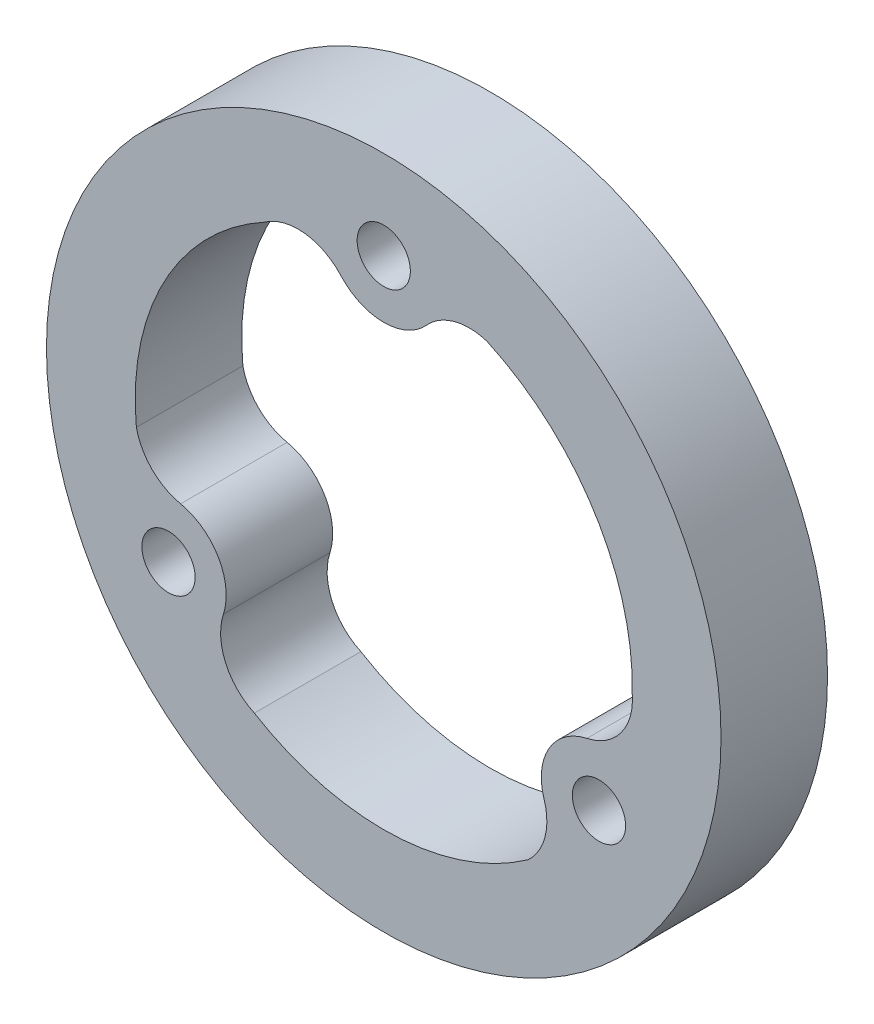
ISO-10303-21;
HEADER;
FILE_DESCRIPTION(('STEP AP214'),'2;1');
FILE_NAME('part.step','',(''),(''),'','','');
FILE_SCHEMA(('AUTOMOTIVE_DESIGN { 1 0 10303 214 1 1 1 1 }'));
ENDSEC;
DATA;
#1=APPLICATION_CONTEXT('core data for automotive mechanical design processes');
#2=APPLICATION_PROTOCOL_DEFINITION('international standard','automotive_design',2000,#1);
#3=PRODUCT_CONTEXT('',#1,'mechanical');
#4=PRODUCT('Part','Part','',(#3));
#5=PRODUCT_RELATED_PRODUCT_CATEGORY('part','',(#4));
#6=PRODUCT_DEFINITION_FORMATION('','',#4);
#7=PRODUCT_DEFINITION_CONTEXT('part definition',#1,'design');
#8=PRODUCT_DEFINITION('design','',#6,#7);
#9=PRODUCT_DEFINITION_SHAPE('','',#8);
#10=(LENGTH_UNIT() NAMED_UNIT(*) SI_UNIT(.MILLI.,.METRE.));
#11=(NAMED_UNIT(*) PLANE_ANGLE_UNIT() SI_UNIT($,.RADIAN.));
#12=(NAMED_UNIT(*) SI_UNIT($,.STERADIAN.) SOLID_ANGLE_UNIT());
#13=UNCERTAINTY_MEASURE_WITH_UNIT(LENGTH_MEASURE(1.E-05),#10,'distance_accuracy_value','');
#14=(GEOMETRIC_REPRESENTATION_CONTEXT(3) GLOBAL_UNCERTAINTY_ASSIGNED_CONTEXT((#13)) GLOBAL_UNIT_ASSIGNED_CONTEXT((#10,
#11,#12)) REPRESENTATION_CONTEXT('',''));
#15=CARTESIAN_POINT('',(0.,0.,0.));
#16=DIRECTION('',(0.,0.,1.));
#17=DIRECTION('',(1.,0.,0.));
#18=AXIS2_PLACEMENT_3D('',#15,#16,#17);
#19=CARTESIAN_POINT('',(0.,0.,6.));
#20=DIRECTION('',(0.,0.,1.));
#21=DIRECTION('',(1.,0.,0.));
#22=AXIS2_PLACEMENT_3D('',#19,#20,#21);
#23=PLANE('',#22);
#24=CARTESIAN_POINT('',(0.,0.,6.));
#25=DIRECTION('',(0.,0.,1.));
#26=DIRECTION('',(1.,0.,0.));
#27=AXIS2_PLACEMENT_3D('',#24,#25,#26);
#28=CIRCLE('',#27,14.);
#29=CARTESIAN_POINT('',(13.9959775932849,-0.335575935174573,6.));
#30=VERTEX_POINT('',#29);
#31=CARTESIAN_POINT('',(5.80943087987062,12.7377593340432,6.));
#32=VERTEX_POINT('',#31);
#33=EDGE_CURVE('E130',#30,#32,#28,.T.);
#34=ORIENTED_EDGE('',*,*,#33,.F.);
#35=CARTESIAN_POINT('',(10.7607074751454,-0.644650784804921,6.));
#36=DIRECTION('',(0.,0.,1.));
#37=DIRECTION('',(1.,0.,0.));
#38=AXIS2_PLACEMENT_3D('',#35,#36,#37);
#39=CIRCLE('',#38,3.25);
#40=CARTESIAN_POINT('',(11.4425315640637,-3.82232539240255,6.));
#41=VERTEX_POINT('',#40);
#42=EDGE_CURVE('E122',#41,#30,#39,.T.);
#43=ORIENTED_EDGE('',*,*,#42,.F.);
#44=CARTESIAN_POINT('',(12.124355652982,-7.00000000000017,6.));
#45=DIRECTION('',(0.,0.,-1.));
#46=DIRECTION('',(1.,0.,0.));
#47=AXIS2_PLACEMENT_3D('',#44,#45,#46);
#48=CIRCLE('',#47,3.25);
#49=CARTESIAN_POINT('',(9.03149667338257,-7.99836032188346,6.));
#50=VERTEX_POINT('',#49);
#51=EDGE_CURVE('E165',#50,#41,#48,.T.);
#52=ORIENTED_EDGE('',*,*,#51,.F.);
#53=CARTESIAN_POINT('',(5.93863769378309,-8.99672064376674,6.));
#54=DIRECTION('',(0.,0.,1.));
#55=DIRECTION('',(1.,0.,0.));
#56=AXIS2_PLACEMENT_3D('',#53,#54,#55);
#57=CIRCLE('',#56,3.25);
#58=CARTESIAN_POINT('',(8.12650773063849,-11.3999943905194,6.));
#59=VERTEX_POINT('',#58);
#60=EDGE_CURVE('E163',#59,#50,#57,.T.);
#61=ORIENTED_EDGE('',*,*,#60,.F.);
#62=CARTESIAN_POINT('',(0.,0.,6.));
#63=DIRECTION('',(0.,0.,1.));
#64=DIRECTION('',(1.,0.,0.));
#65=AXIS2_PLACEMENT_3D('',#62,#63,#64);
#66=CIRCLE('',#65,14.);
#67=CARTESIAN_POINT('',(-7.28860608140232,-11.9530841789952,6.));
#68=VERTEX_POINT('',#67);
#69=EDGE_CURVE('E161',#68,#59,#66,.T.);
#70=ORIENTED_EDGE('',*,*,#69,.F.);
#71=CARTESIAN_POINT('',(-5.93863769378334,-8.99672064376658,6.));
#72=DIRECTION('',(0.,0.,1.));
#73=DIRECTION('',(1.,0.,0.));
#74=AXIS2_PLACEMENT_3D('',#71,#72,#73);
#75=CIRCLE('',#74,3.25);
#76=CARTESIAN_POINT('',(-9.03149667338279,-7.9983603218832,6.));
#77=VERTEX_POINT('',#76);
#78=EDGE_CURVE('E159',#77,#68,#75,.T.);
#79=ORIENTED_EDGE('',*,*,#78,.F.);
#80=CARTESIAN_POINT('',(-12.1243556529822,-6.99999999999983,6.));
#81=DIRECTION('',(0.,0.,-1.));
#82=DIRECTION('',(1.,0.,0.));
#83=AXIS2_PLACEMENT_3D('',#80,#81,#82);
#84=CIRCLE('',#83,3.25);
#85=CARTESIAN_POINT('',(-11.4425315640638,-3.82232539240223,6.));
#86=VERTEX_POINT('',#85);
#87=EDGE_CURVE('E157',#86,#77,#84,.T.);
#88=ORIENTED_EDGE('',*,*,#87,.F.);
#89=CARTESIAN_POINT('',(-10.7607074751454,-0.644650784804622,6.));
#90=DIRECTION('',(0.,0.,1.));
#91=DIRECTION('',(1.,0.,0.));
#92=AXIS2_PLACEMENT_3D('',#89,#90,#91);
#93=CIRCLE('',#92,3.25);
#94=CARTESIAN_POINT('',(-13.9359386105091,-1.33776494352389,6.));
#95=VERTEX_POINT('',#94);
#96=EDGE_CURVE('E155',#95,#86,#93,.T.);
#97=ORIENTED_EDGE('',*,*,#96,.F.);
#98=CARTESIAN_POINT('',(0.,0.,6.));
#99=DIRECTION('',(0.,0.,1.));
#100=DIRECTION('',(1.,0.,0.));
#101=AXIS2_PLACEMENT_3D('',#98,#99,#100);
#102=CIRCLE('',#101,14.);
#103=CARTESIAN_POINT('',(-6.70737151188253,12.2886601141698,6.));
#104=VERTEX_POINT('',#103);
#105=EDGE_CURVE('E153',#104,#95,#102,.T.);
#106=ORIENTED_EDGE('',*,*,#105,.F.);
#107=CARTESIAN_POINT('',(-4.82206978136206,9.6413714285715,6.));
#108=DIRECTION('',(0.,0.,1.));
#109=DIRECTION('',(1.,0.,0.));
#110=AXIS2_PLACEMENT_3D('',#107,#108,#109);
#111=CIRCLE('',#110,3.25);
#112=CARTESIAN_POINT('',(-2.41103489068093,11.8206857142857,6.));
#113=VERTEX_POINT('',#112);
#114=EDGE_CURVE('E151',#113,#104,#111,.T.);
#115=ORIENTED_EDGE('',*,*,#114,.F.);
#116=CARTESIAN_POINT('',(2.01075991198358E-13,14.,6.));
#117=DIRECTION('',(0.,0.,-1.));
#118=DIRECTION('',(1.,0.,0.));
#119=AXIS2_PLACEMENT_3D('',#116,#117,#118);
#120=CIRCLE('',#119,3.25);
#121=CARTESIAN_POINT('',(2.41103489068127,11.8206857142857,6.));
#122=VERTEX_POINT('',#121);
#123=EDGE_CURVE('E146',#122,#113,#120,.T.);
#124=ORIENTED_EDGE('',*,*,#123,.F.);
#125=CARTESIAN_POINT('',(4.82206978136234,9.64137142857136,6.));
#126=DIRECTION('',(0.,0.,1.));
#127=DIRECTION('',(1.,0.,0.));
#128=AXIS2_PLACEMENT_3D('',#125,#126,#127);
#129=CIRCLE('',#128,3.25);
#130=EDGE_CURVE('E144',#32,#122,#129,.T.);
#131=ORIENTED_EDGE('',*,*,#130,.F.);
#132=EDGE_LOOP('',(#34,#43,#52,#61,#70,#79,#88,#97,#106,#115,#124,#131));
#133=FACE_BOUND('',#132,.T.);
#134=CARTESIAN_POINT('',(12.124355652982,-7.00000000000017,6.));
#135=DIRECTION('',(0.,0.,1.));
#136=DIRECTION('',(1.,0.,0.));
#137=AXIS2_PLACEMENT_3D('',#134,#135,#136);
#138=CIRCLE('',#137,1.50000000000007);
#139=CARTESIAN_POINT('',(13.6243556529821,-7.00000000000017,6.));
#140=VERTEX_POINT('',#139);
#141=EDGE_CURVE('E218',#140,#140,#138,.T.);
#142=ORIENTED_EDGE('',*,*,#141,.F.);
#143=EDGE_LOOP('',(#142));
#144=FACE_BOUND('',#143,.T.);
#145=CARTESIAN_POINT('',(0.,0.,6.));
#146=DIRECTION('',(0.,0.,1.));
#147=DIRECTION('',(1.,0.,0.));
#148=AXIS2_PLACEMENT_3D('',#145,#146,#147);
#149=CIRCLE('',#148,19.);
#150=CARTESIAN_POINT('',(19.,0.,6.));
#151=VERTEX_POINT('',#150);
#152=EDGE_CURVE('E11',#151,#151,#149,.T.);
#153=ORIENTED_EDGE('',*,*,#152,.T.);
#154=EDGE_LOOP('',(#153));
#155=FACE_BOUND('',#154,.T.);
#156=CARTESIAN_POINT('',(2.01075991198358E-13,14.,6.));
#157=DIRECTION('',(0.,0.,1.));
#158=DIRECTION('',(1.,0.,0.));
#159=AXIS2_PLACEMENT_3D('',#156,#157,#158);
#160=CIRCLE('',#159,1.5);
#161=CARTESIAN_POINT('',(1.5000000000002,14.,6.));
#162=VERTEX_POINT('',#161);
#163=EDGE_CURVE('E224',#162,#162,#160,.T.);
#164=ORIENTED_EDGE('',*,*,#163,.F.);
#165=EDGE_LOOP('',(#164));
#166=FACE_BOUND('',#165,.T.);
#167=CARTESIAN_POINT('',(-12.1243556529822,-6.99999999999983,6.));
#168=DIRECTION('',(0.,0.,1.));
#169=DIRECTION('',(1.,0.,0.));
#170=AXIS2_PLACEMENT_3D('',#167,#168,#169);
#171=CIRCLE('',#170,1.5);
#172=CARTESIAN_POINT('',(-10.6243556529822,-6.99999999999983,6.));
#173=VERTEX_POINT('',#172);
#174=EDGE_CURVE('E168',#173,#173,#171,.T.);
#175=ORIENTED_EDGE('',*,*,#174,.F.);
#176=EDGE_LOOP('',(#175));
#177=FACE_BOUND('',#176,.T.);
#178=ADVANCED_FACE('F33',(#133,#144,#155,#166,#177),#23,.T.);
#179=CARTESIAN_POINT('',(0.,0.,0.));
#180=DIRECTION('',(0.,0.,1.));
#181=DIRECTION('',(1.,0.,0.));
#182=AXIS2_PLACEMENT_3D('',#179,#180,#181);
#183=PLANE('',#182);
#184=CARTESIAN_POINT('',(12.124355652982,-7.00000000000017,0.));
#185=DIRECTION('',(0.,0.,1.));
#186=DIRECTION('',(1.,0.,0.));
#187=AXIS2_PLACEMENT_3D('',#184,#185,#186);
#188=CIRCLE('',#187,1.50000000000007);
#189=CARTESIAN_POINT('',(13.6243556529821,-7.00000000000017,0.));
#190=VERTEX_POINT('',#189);
#191=EDGE_CURVE('E138',#190,#190,#188,.T.);
#192=ORIENTED_EDGE('',*,*,#191,.T.);
#193=EDGE_LOOP('',(#192));
#194=FACE_BOUND('',#193,.T.);
#195=CARTESIAN_POINT('',(2.01075991198358E-13,14.,0.));
#196=DIRECTION('',(0.,0.,1.));
#197=DIRECTION('',(1.,0.,0.));
#198=AXIS2_PLACEMENT_3D('',#195,#196,#197);
#199=CIRCLE('',#198,1.5);
#200=CARTESIAN_POINT('',(1.5000000000002,14.,0.));
#201=VERTEX_POINT('',#200);
#202=EDGE_CURVE('E221',#201,#201,#199,.T.);
#203=ORIENTED_EDGE('',*,*,#202,.T.);
#204=EDGE_LOOP('',(#203));
#205=FACE_BOUND('',#204,.T.);
#206=CARTESIAN_POINT('',(0.,0.,0.));
#207=DIRECTION('',(0.,0.,1.));
#208=DIRECTION('',(1.,0.,0.));
#209=AXIS2_PLACEMENT_3D('',#206,#207,#208);
#210=CIRCLE('',#209,19.);
#211=CARTESIAN_POINT('',(19.,0.,0.));
#212=VERTEX_POINT('',#211);
#213=EDGE_CURVE('E37',#212,#212,#210,.T.);
#214=ORIENTED_EDGE('',*,*,#213,.F.);
#215=EDGE_LOOP('',(#214));
#216=FACE_BOUND('',#215,.T.);
#217=CARTESIAN_POINT('',(10.7607074751454,-0.644650784804921,0.));
#218=DIRECTION('',(0.,0.,1.));
#219=DIRECTION('',(1.,0.,0.));
#220=AXIS2_PLACEMENT_3D('',#217,#218,#219);
#221=CIRCLE('',#220,3.25);
#222=CARTESIAN_POINT('',(11.4425315640637,-3.82232539240255,0.));
#223=VERTEX_POINT('',#222);
#224=CARTESIAN_POINT('',(13.9959775932849,-0.335575935174573,0.));
#225=VERTEX_POINT('',#224);
#226=EDGE_CURVE('E56',#223,#225,#221,.T.);
#227=ORIENTED_EDGE('',*,*,#226,.T.);
#228=CARTESIAN_POINT('',(0.,0.,0.));
#229=DIRECTION('',(0.,0.,1.));
#230=DIRECTION('',(1.,0.,0.));
#231=AXIS2_PLACEMENT_3D('',#228,#229,#230);
#232=CIRCLE('',#231,14.);
#233=CARTESIAN_POINT('',(5.80943087987062,12.7377593340432,0.));
#234=VERTEX_POINT('',#233);
#235=EDGE_CURVE('E137',#225,#234,#232,.T.);
#236=ORIENTED_EDGE('',*,*,#235,.T.);
#237=CARTESIAN_POINT('',(4.82206978136234,9.64137142857136,0.));
#238=DIRECTION('',(0.,0.,1.));
#239=DIRECTION('',(1.,0.,0.));
#240=AXIS2_PLACEMENT_3D('',#237,#238,#239);
#241=CIRCLE('',#240,3.25);
#242=CARTESIAN_POINT('',(2.41103489068127,11.8206857142857,0.));
#243=VERTEX_POINT('',#242);
#244=EDGE_CURVE('E170',#234,#243,#241,.T.);
#245=ORIENTED_EDGE('',*,*,#244,.T.);
#246=CARTESIAN_POINT('',(2.01075991198358E-13,14.,0.));
#247=DIRECTION('',(0.,0.,-1.));
#248=DIRECTION('',(1.,0.,0.));
#249=AXIS2_PLACEMENT_3D('',#246,#247,#248);
#250=CIRCLE('',#249,3.25);
#251=CARTESIAN_POINT('',(-2.41103489068093,11.8206857142857,0.));
#252=VERTEX_POINT('',#251);
#253=EDGE_CURVE('E173',#243,#252,#250,.T.);
#254=ORIENTED_EDGE('',*,*,#253,.T.);
#255=CARTESIAN_POINT('',(-4.82206978136206,9.6413714285715,0.));
#256=DIRECTION('',(0.,0.,1.));
#257=DIRECTION('',(1.,0.,0.));
#258=AXIS2_PLACEMENT_3D('',#255,#256,#257);
#259=CIRCLE('',#258,3.25);
#260=CARTESIAN_POINT('',(-6.70737151188253,12.2886601141698,0.));
#261=VERTEX_POINT('',#260);
#262=EDGE_CURVE('E176',#252,#261,#259,.T.);
#263=ORIENTED_EDGE('',*,*,#262,.T.);
#264=CARTESIAN_POINT('',(0.,0.,0.));
#265=DIRECTION('',(0.,0.,1.));
#266=DIRECTION('',(1.,0.,0.));
#267=AXIS2_PLACEMENT_3D('',#264,#265,#266);
#268=CIRCLE('',#267,14.);
#269=CARTESIAN_POINT('',(-13.9359386105091,-1.33776494352389,0.));
#270=VERTEX_POINT('',#269);
#271=EDGE_CURVE('E179',#261,#270,#268,.T.);
#272=ORIENTED_EDGE('',*,*,#271,.T.);
#273=CARTESIAN_POINT('',(-10.7607074751454,-0.644650784804622,0.));
#274=DIRECTION('',(0.,0.,1.));
#275=DIRECTION('',(1.,0.,0.));
#276=AXIS2_PLACEMENT_3D('',#273,#274,#275);
#277=CIRCLE('',#276,3.25);
#278=CARTESIAN_POINT('',(-11.4425315640638,-3.82232539240223,0.));
#279=VERTEX_POINT('',#278);
#280=EDGE_CURVE('E182',#270,#279,#277,.T.);
#281=ORIENTED_EDGE('',*,*,#280,.T.);
#282=CARTESIAN_POINT('',(-12.1243556529822,-6.99999999999983,0.));
#283=DIRECTION('',(0.,0.,-1.));
#284=DIRECTION('',(1.,0.,0.));
#285=AXIS2_PLACEMENT_3D('',#282,#283,#284);
#286=CIRCLE('',#285,3.25);
#287=CARTESIAN_POINT('',(-9.03149667338279,-7.9983603218832,0.));
#288=VERTEX_POINT('',#287);
#289=EDGE_CURVE('E185',#279,#288,#286,.T.);
#290=ORIENTED_EDGE('',*,*,#289,.T.);
#291=CARTESIAN_POINT('',(-5.93863769378334,-8.99672064376658,0.));
#292=DIRECTION('',(0.,0.,1.));
#293=DIRECTION('',(1.,0.,0.));
#294=AXIS2_PLACEMENT_3D('',#291,#292,#293);
#295=CIRCLE('',#294,3.25);
#296=CARTESIAN_POINT('',(-7.28860608140232,-11.9530841789952,0.));
#297=VERTEX_POINT('',#296);
#298=EDGE_CURVE('E188',#288,#297,#295,.T.);
#299=ORIENTED_EDGE('',*,*,#298,.T.);
#300=CARTESIAN_POINT('',(0.,0.,0.));
#301=DIRECTION('',(0.,0.,1.));
#302=DIRECTION('',(1.,0.,0.));
#303=AXIS2_PLACEMENT_3D('',#300,#301,#302);
#304=CIRCLE('',#303,14.);
#305=CARTESIAN_POINT('',(8.12650773063849,-11.3999943905194,0.));
#306=VERTEX_POINT('',#305);
#307=EDGE_CURVE('E191',#297,#306,#304,.T.);
#308=ORIENTED_EDGE('',*,*,#307,.T.);
#309=CARTESIAN_POINT('',(5.93863769378309,-8.99672064376674,0.));
#310=DIRECTION('',(0.,0.,1.));
#311=DIRECTION('',(1.,0.,0.));
#312=AXIS2_PLACEMENT_3D('',#309,#310,#311);
#313=CIRCLE('',#312,3.25);
#314=CARTESIAN_POINT('',(9.03149667338257,-7.99836032188346,0.));
#315=VERTEX_POINT('',#314);
#316=EDGE_CURVE('E194',#306,#315,#313,.T.);
#317=ORIENTED_EDGE('',*,*,#316,.T.);
#318=CARTESIAN_POINT('',(12.124355652982,-7.00000000000017,0.));
#319=DIRECTION('',(0.,0.,-1.));
#320=DIRECTION('',(1.,0.,0.));
#321=AXIS2_PLACEMENT_3D('',#318,#319,#320);
#322=CIRCLE('',#321,3.25);
#323=EDGE_CURVE('E131',#315,#223,#322,.T.);
#324=ORIENTED_EDGE('',*,*,#323,.T.);
#325=EDGE_LOOP('',(#227,#236,#245,#254,#263,#272,#281,#290,#299,#308,#317,#324));
#326=FACE_BOUND('',#325,.T.);
#327=CARTESIAN_POINT('',(-12.1243556529822,-6.99999999999983,0.));
#328=DIRECTION('',(0.,0.,1.));
#329=DIRECTION('',(1.,0.,0.));
#330=AXIS2_PLACEMENT_3D('',#327,#328,#329);
#331=CIRCLE('',#330,1.5);
#332=CARTESIAN_POINT('',(-10.6243556529822,-6.99999999999983,0.));
#333=VERTEX_POINT('',#332);
#334=EDGE_CURVE('E403',#333,#333,#331,.T.);
#335=ORIENTED_EDGE('',*,*,#334,.T.);
#336=EDGE_LOOP('',(#335));
#337=FACE_BOUND('',#336,.T.);
#338=ADVANCED_FACE('F230',(#194,#205,#216,#326,#337),#183,.F.);
#339=CARTESIAN_POINT('',(0.,0.,6.));
#340=DIRECTION('',(0.,0.,-1.));
#341=DIRECTION('',(-1.,0.,0.));
#342=AXIS2_PLACEMENT_3D('',#339,#340,#341);
#343=CYLINDRICAL_SURFACE('',#342,19.);
#344=ORIENTED_EDGE('',*,*,#152,.F.);
#345=EDGE_LOOP('',(#344));
#346=FACE_BOUND('',#345,.T.);
#347=ORIENTED_EDGE('',*,*,#213,.T.);
#348=EDGE_LOOP('',(#347));
#349=FACE_BOUND('',#348,.T.);
#350=ADVANCED_FACE('F35',(#346,#349),#343,.T.);
#351=CARTESIAN_POINT('',(2.01075991198358E-13,14.,6.));
#352=DIRECTION('',(0.,0.,-1.));
#353=DIRECTION('',(-1.,0.,0.));
#354=AXIS2_PLACEMENT_3D('',#351,#352,#353);
#355=CYLINDRICAL_SURFACE('',#354,1.5);
#356=ORIENTED_EDGE('',*,*,#163,.T.);
#357=EDGE_LOOP('',(#356));
#358=FACE_BOUND('',#357,.T.);
#359=ORIENTED_EDGE('',*,*,#202,.F.);
#360=EDGE_LOOP('',(#359));
#361=FACE_BOUND('',#360,.T.);
#362=ADVANCED_FACE('F233',(#358,#361),#355,.F.);
#363=CARTESIAN_POINT('',(12.124355652982,-7.00000000000017,6.));
#364=DIRECTION('',(0.,0.,-1.));
#365=DIRECTION('',(-1.,0.,0.));
#366=AXIS2_PLACEMENT_3D('',#363,#364,#365);
#367=CYLINDRICAL_SURFACE('',#366,1.50000000000007);
#368=ORIENTED_EDGE('',*,*,#141,.T.);
#369=EDGE_LOOP('',(#368));
#370=FACE_BOUND('',#369,.T.);
#371=ORIENTED_EDGE('',*,*,#191,.F.);
#372=EDGE_LOOP('',(#371));
#373=FACE_BOUND('',#372,.T.);
#374=ADVANCED_FACE('F235',(#370,#373),#367,.F.);
#375=CARTESIAN_POINT('',(10.7607074751454,-0.644650784804921,6.));
#376=DIRECTION('',(0.,0.,-1.));
#377=DIRECTION('',(-1.,0.,0.));
#378=AXIS2_PLACEMENT_3D('',#375,#376,#377);
#379=CYLINDRICAL_SURFACE('',#378,3.25);
#380=ORIENTED_EDGE('',*,*,#226,.F.);
#381=DIRECTION('',(0.,0.,-1.));
#382=VECTOR('',#381,1.);
#383=CARTESIAN_POINT('',(11.4425315640637,-3.82232539240255,6.));
#384=LINE('',#383,#382);
#385=EDGE_CURVE('E126',#41,#223,#384,.T.);
#386=ORIENTED_EDGE('',*,*,#385,.F.);
#387=ORIENTED_EDGE('',*,*,#42,.T.);
#388=DIRECTION('',(0.,0.,-1.));
#389=VECTOR('',#388,1.);
#390=CARTESIAN_POINT('',(13.9959775932849,-0.335575935174573,6.));
#391=LINE('',#390,#389);
#392=EDGE_CURVE('E125',#30,#225,#391,.T.);
#393=ORIENTED_EDGE('',*,*,#392,.T.);
#394=EDGE_LOOP('',(#380,#386,#387,#393));
#395=FACE_BOUND('',#394,.T.);
#396=ADVANCED_FACE('F124',(#395),#379,.F.);
#397=CARTESIAN_POINT('',(0.,0.,6.));
#398=DIRECTION('',(0.,0.,-1.));
#399=DIRECTION('',(-1.,0.,0.));
#400=AXIS2_PLACEMENT_3D('',#397,#398,#399);
#401=CYLINDRICAL_SURFACE('',#400,14.);
#402=ORIENTED_EDGE('',*,*,#235,.F.);
#403=ORIENTED_EDGE('',*,*,#392,.F.);
#404=ORIENTED_EDGE('',*,*,#33,.T.);
#405=DIRECTION('',(0.,0.,-1.));
#406=VECTOR('',#405,1.);
#407=CARTESIAN_POINT('',(5.80943087987062,12.7377593340432,6.));
#408=LINE('',#407,#406);
#409=EDGE_CURVE('E139',#32,#234,#408,.T.);
#410=ORIENTED_EDGE('',*,*,#409,.T.);
#411=EDGE_LOOP('',(#402,#403,#404,#410));
#412=FACE_BOUND('',#411,.T.);
#413=ADVANCED_FACE('F134',(#412),#401,.F.);
#414=CARTESIAN_POINT('',(4.82206978136234,9.64137142857136,6.));
#415=DIRECTION('',(0.,0.,-1.));
#416=DIRECTION('',(-1.,0.,0.));
#417=AXIS2_PLACEMENT_3D('',#414,#415,#416);
#418=CYLINDRICAL_SURFACE('',#417,3.25);
#419=ORIENTED_EDGE('',*,*,#244,.F.);
#420=ORIENTED_EDGE('',*,*,#409,.F.);
#421=ORIENTED_EDGE('',*,*,#130,.T.);
#422=DIRECTION('',(0.,0.,-1.));
#423=VECTOR('',#422,1.);
#424=CARTESIAN_POINT('',(2.41103489068127,11.8206857142857,6.));
#425=LINE('',#424,#423);
#426=EDGE_CURVE('E215',#122,#243,#425,.T.);
#427=ORIENTED_EDGE('',*,*,#426,.T.);
#428=EDGE_LOOP('',(#419,#420,#421,#427));
#429=FACE_BOUND('',#428,.T.);
#430=ADVANCED_FACE('F286',(#429),#418,.F.);
#431=CARTESIAN_POINT('',(2.01075991198358E-13,14.,6.));
#432=DIRECTION('',(0.,0.,-1.));
#433=DIRECTION('',(-1.,0.,0.));
#434=AXIS2_PLACEMENT_3D('',#431,#432,#433);
#435=CYLINDRICAL_SURFACE('',#434,3.25);
#436=ORIENTED_EDGE('',*,*,#253,.F.);
#437=ORIENTED_EDGE('',*,*,#426,.F.);
#438=ORIENTED_EDGE('',*,*,#123,.T.);
#439=DIRECTION('',(0.,0.,-1.));
#440=VECTOR('',#439,1.);
#441=CARTESIAN_POINT('',(-2.41103489068093,11.8206857142857,6.));
#442=LINE('',#441,#440);
#443=EDGE_CURVE('E213',#113,#252,#442,.T.);
#444=ORIENTED_EDGE('',*,*,#443,.T.);
#445=EDGE_LOOP('',(#436,#437,#438,#444));
#446=FACE_BOUND('',#445,.T.);
#447=ADVANCED_FACE('F295',(#446),#435,.T.);
#448=CARTESIAN_POINT('',(-4.82206978136206,9.6413714285715,6.));
#449=DIRECTION('',(0.,0.,-1.));
#450=DIRECTION('',(-1.,0.,0.));
#451=AXIS2_PLACEMENT_3D('',#448,#449,#450);
#452=CYLINDRICAL_SURFACE('',#451,3.25);
#453=ORIENTED_EDGE('',*,*,#262,.F.);
#454=ORIENTED_EDGE('',*,*,#443,.F.);
#455=ORIENTED_EDGE('',*,*,#114,.T.);
#456=DIRECTION('',(0.,0.,-1.));
#457=VECTOR('',#456,1.);
#458=CARTESIAN_POINT('',(-6.70737151188253,12.2886601141698,6.));
#459=LINE('',#458,#457);
#460=EDGE_CURVE('E211',#104,#261,#459,.T.);
#461=ORIENTED_EDGE('',*,*,#460,.T.);
#462=EDGE_LOOP('',(#453,#454,#455,#461));
#463=FACE_BOUND('',#462,.T.);
#464=ADVANCED_FACE('F305',(#463),#452,.F.);
#465=CARTESIAN_POINT('',(0.,0.,6.));
#466=DIRECTION('',(0.,0.,-1.));
#467=DIRECTION('',(-1.,0.,0.));
#468=AXIS2_PLACEMENT_3D('',#465,#466,#467);
#469=CYLINDRICAL_SURFACE('',#468,14.);
#470=ORIENTED_EDGE('',*,*,#271,.F.);
#471=ORIENTED_EDGE('',*,*,#460,.F.);
#472=ORIENTED_EDGE('',*,*,#105,.T.);
#473=DIRECTION('',(0.,0.,-1.));
#474=VECTOR('',#473,1.);
#475=CARTESIAN_POINT('',(-13.9359386105091,-1.33776494352389,6.));
#476=LINE('',#475,#474);
#477=EDGE_CURVE('E209',#95,#270,#476,.T.);
#478=ORIENTED_EDGE('',*,*,#477,.T.);
#479=EDGE_LOOP('',(#470,#471,#472,#478));
#480=FACE_BOUND('',#479,.T.);
#481=ADVANCED_FACE('F315',(#480),#469,.F.);
#482=CARTESIAN_POINT('',(-10.7607074751454,-0.644650784804622,6.));
#483=DIRECTION('',(0.,0.,-1.));
#484=DIRECTION('',(-1.,0.,0.));
#485=AXIS2_PLACEMENT_3D('',#482,#483,#484);
#486=CYLINDRICAL_SURFACE('',#485,3.25);
#487=ORIENTED_EDGE('',*,*,#280,.F.);
#488=ORIENTED_EDGE('',*,*,#477,.F.);
#489=ORIENTED_EDGE('',*,*,#96,.T.);
#490=DIRECTION('',(0.,0.,-1.));
#491=VECTOR('',#490,1.);
#492=CARTESIAN_POINT('',(-11.4425315640638,-3.82232539240223,6.));
#493=LINE('',#492,#491);
#494=EDGE_CURVE('E207',#86,#279,#493,.T.);
#495=ORIENTED_EDGE('',*,*,#494,.T.);
#496=EDGE_LOOP('',(#487,#488,#489,#495));
#497=FACE_BOUND('',#496,.T.);
#498=ADVANCED_FACE('F325',(#497),#486,.F.);
#499=CARTESIAN_POINT('',(-12.1243556529822,-6.99999999999983,6.));
#500=DIRECTION('',(0.,0.,-1.));
#501=DIRECTION('',(-1.,0.,0.));
#502=AXIS2_PLACEMENT_3D('',#499,#500,#501);
#503=CYLINDRICAL_SURFACE('',#502,3.25);
#504=ORIENTED_EDGE('',*,*,#289,.F.);
#505=ORIENTED_EDGE('',*,*,#494,.F.);
#506=ORIENTED_EDGE('',*,*,#87,.T.);
#507=DIRECTION('',(0.,0.,-1.));
#508=VECTOR('',#507,1.);
#509=CARTESIAN_POINT('',(-9.03149667338279,-7.9983603218832,6.));
#510=LINE('',#509,#508);
#511=EDGE_CURVE('E205',#77,#288,#510,.T.);
#512=ORIENTED_EDGE('',*,*,#511,.T.);
#513=EDGE_LOOP('',(#504,#505,#506,#512));
#514=FACE_BOUND('',#513,.T.);
#515=ADVANCED_FACE('F335',(#514),#503,.T.);
#516=CARTESIAN_POINT('',(-5.93863769378334,-8.99672064376658,6.));
#517=DIRECTION('',(0.,0.,-1.));
#518=DIRECTION('',(-1.,0.,0.));
#519=AXIS2_PLACEMENT_3D('',#516,#517,#518);
#520=CYLINDRICAL_SURFACE('',#519,3.25);
#521=ORIENTED_EDGE('',*,*,#298,.F.);
#522=ORIENTED_EDGE('',*,*,#511,.F.);
#523=ORIENTED_EDGE('',*,*,#78,.T.);
#524=DIRECTION('',(0.,0.,-1.));
#525=VECTOR('',#524,1.);
#526=CARTESIAN_POINT('',(-7.28860608140232,-11.9530841789952,6.));
#527=LINE('',#526,#525);
#528=EDGE_CURVE('E203',#68,#297,#527,.T.);
#529=ORIENTED_EDGE('',*,*,#528,.T.);
#530=EDGE_LOOP('',(#521,#522,#523,#529));
#531=FACE_BOUND('',#530,.T.);
#532=ADVANCED_FACE('F345',(#531),#520,.F.);
#533=CARTESIAN_POINT('',(0.,0.,6.));
#534=DIRECTION('',(0.,0.,-1.));
#535=DIRECTION('',(-1.,0.,0.));
#536=AXIS2_PLACEMENT_3D('',#533,#534,#535);
#537=CYLINDRICAL_SURFACE('',#536,14.);
#538=ORIENTED_EDGE('',*,*,#307,.F.);
#539=ORIENTED_EDGE('',*,*,#528,.F.);
#540=ORIENTED_EDGE('',*,*,#69,.T.);
#541=DIRECTION('',(0.,0.,-1.));
#542=VECTOR('',#541,1.);
#543=CARTESIAN_POINT('',(8.12650773063849,-11.3999943905194,6.));
#544=LINE('',#543,#542);
#545=EDGE_CURVE('E201',#59,#306,#544,.T.);
#546=ORIENTED_EDGE('',*,*,#545,.T.);
#547=EDGE_LOOP('',(#538,#539,#540,#546));
#548=FACE_BOUND('',#547,.T.);
#549=ADVANCED_FACE('F355',(#548),#537,.F.);
#550=CARTESIAN_POINT('',(5.93863769378309,-8.99672064376674,6.));
#551=DIRECTION('',(0.,0.,-1.));
#552=DIRECTION('',(-1.,0.,0.));
#553=AXIS2_PLACEMENT_3D('',#550,#551,#552);
#554=CYLINDRICAL_SURFACE('',#553,3.25);
#555=ORIENTED_EDGE('',*,*,#316,.F.);
#556=ORIENTED_EDGE('',*,*,#545,.F.);
#557=ORIENTED_EDGE('',*,*,#60,.T.);
#558=DIRECTION('',(0.,0.,-1.));
#559=VECTOR('',#558,1.);
#560=CARTESIAN_POINT('',(9.03149667338257,-7.99836032188346,6.));
#561=LINE('',#560,#559);
#562=EDGE_CURVE('E48',#50,#315,#561,.T.);
#563=ORIENTED_EDGE('',*,*,#562,.T.);
#564=EDGE_LOOP('',(#555,#556,#557,#563));
#565=FACE_BOUND('',#564,.T.);
#566=ADVANCED_FACE('F365',(#565),#554,.F.);
#567=CARTESIAN_POINT('',(12.124355652982,-7.00000000000017,6.));
#568=DIRECTION('',(0.,0.,-1.));
#569=DIRECTION('',(-1.,0.,0.));
#570=AXIS2_PLACEMENT_3D('',#567,#568,#569);
#571=CYLINDRICAL_SURFACE('',#570,3.25);
#572=ORIENTED_EDGE('',*,*,#323,.F.);
#573=ORIENTED_EDGE('',*,*,#562,.F.);
#574=ORIENTED_EDGE('',*,*,#51,.T.);
#575=ORIENTED_EDGE('',*,*,#385,.T.);
#576=EDGE_LOOP('',(#572,#573,#574,#575));
#577=FACE_BOUND('',#576,.T.);
#578=ADVANCED_FACE('F375',(#577),#571,.T.);
#579=CARTESIAN_POINT('',(-12.1243556529822,-6.99999999999983,6.));
#580=DIRECTION('',(0.,0.,-1.));
#581=DIRECTION('',(-1.,0.,0.));
#582=AXIS2_PLACEMENT_3D('',#579,#580,#581);
#583=CYLINDRICAL_SURFACE('',#582,1.5);
#584=ORIENTED_EDGE('',*,*,#174,.T.);
#585=EDGE_LOOP('',(#584));
#586=FACE_BOUND('',#585,.T.);
#587=ORIENTED_EDGE('',*,*,#334,.F.);
#588=EDGE_LOOP('',(#587));
#589=FACE_BOUND('',#588,.T.);
#590=ADVANCED_FACE('F385',(#586,#589),#583,.F.);
#591=CLOSED_SHELL('',(#178,#338,#350,#362,#374,#396,#413,#430,#447,#464,#481,#498,#515,#532,
#549,#566,#578,#590));
#592=MANIFOLD_SOLID_BREP('B2',#591);
#593=ADVANCED_BREP_SHAPE_REPRESENTATION('',(#18,#592),#14);
#594=SHAPE_DEFINITION_REPRESENTATION(#9,#593);
ENDSEC;
END-ISO-10303-21;
